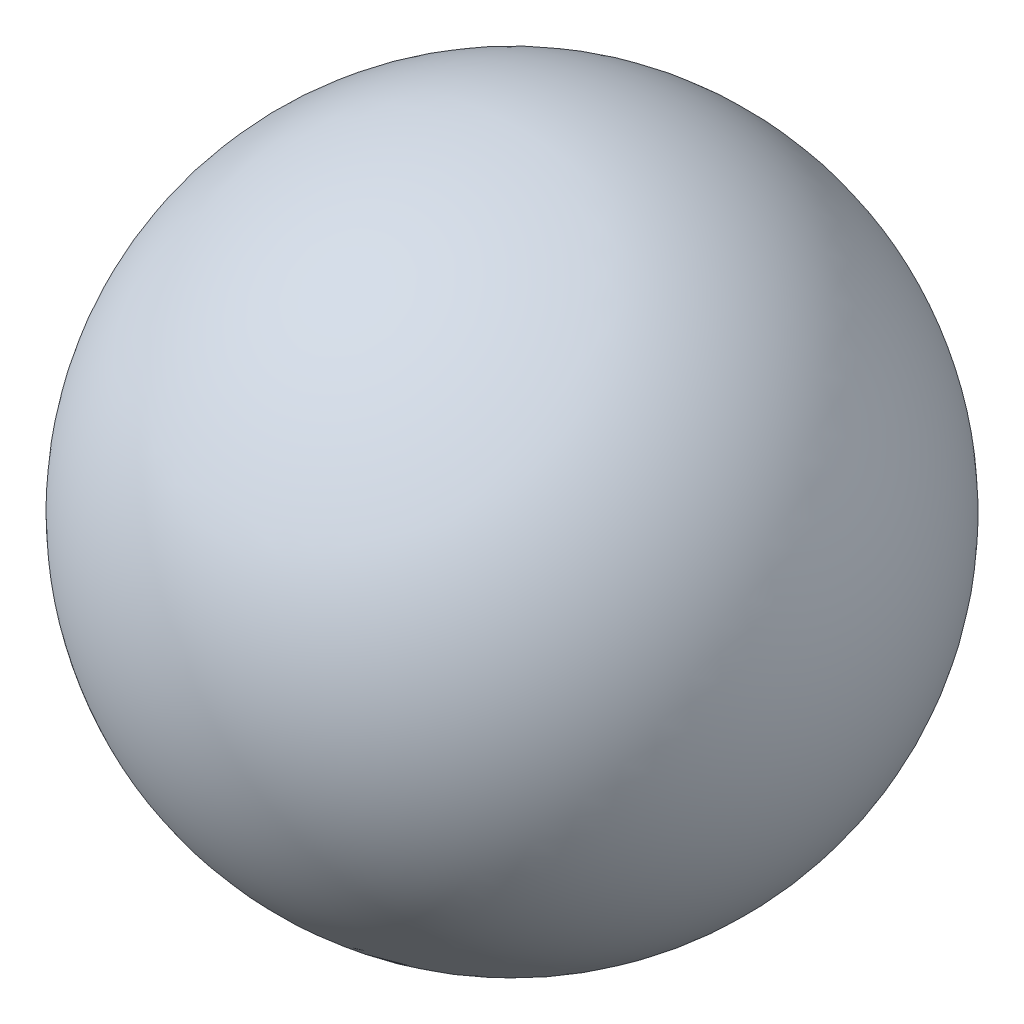
ISO-10303-21;
HEADER;
FILE_DESCRIPTION(('STEP AP214'),'2;1');
FILE_NAME('part.step','',(''),(''),'','','');
FILE_SCHEMA(('AUTOMOTIVE_DESIGN { 1 0 10303 214 1 1 1 1 }'));
ENDSEC;
DATA;
#1=APPLICATION_CONTEXT('core data for automotive mechanical design processes');
#2=APPLICATION_PROTOCOL_DEFINITION('international standard','automotive_design',2000,#1);
#3=PRODUCT_CONTEXT('',#1,'mechanical');
#4=PRODUCT('Part','Part','',(#3));
#5=PRODUCT_RELATED_PRODUCT_CATEGORY('part','',(#4));
#6=PRODUCT_DEFINITION_FORMATION('','',#4);
#7=PRODUCT_DEFINITION_CONTEXT('part definition',#1,'design');
#8=PRODUCT_DEFINITION('design','',#6,#7);
#9=PRODUCT_DEFINITION_SHAPE('','',#8);
#10=(LENGTH_UNIT() NAMED_UNIT(*) SI_UNIT(.MILLI.,.METRE.));
#11=(NAMED_UNIT(*) PLANE_ANGLE_UNIT() SI_UNIT($,.RADIAN.));
#12=(NAMED_UNIT(*) SI_UNIT($,.STERADIAN.) SOLID_ANGLE_UNIT());
#13=UNCERTAINTY_MEASURE_WITH_UNIT(LENGTH_MEASURE(1.E-05),#10,'distance_accuracy_value','');
#14=(GEOMETRIC_REPRESENTATION_CONTEXT(3) GLOBAL_UNCERTAINTY_ASSIGNED_CONTEXT((#13)) GLOBAL_UNIT_ASSIGNED_CONTEXT((#10,
#11,#12)) REPRESENTATION_CONTEXT('',''));
#15=CARTESIAN_POINT('',(0.,0.,0.));
#16=DIRECTION('',(0.,0.,1.));
#17=DIRECTION('',(1.,0.,0.));
#18=AXIS2_PLACEMENT_3D('',#15,#16,#17);
#19=CARTESIAN_POINT('',(64.16,8.84745707434975,68.816590966987));
#20=DIRECTION('',(0.,0.127516208211662,0.991836486848176));
#21=DIRECTION('',(0.173648177666934,-0.976768261968468,0.125578950481563));
#22=AXIS2_PLACEMENT_3D('',#19,#20,#21);
#23=SPHERICAL_SURFACE('',#22,7.15);
#24=CARTESIAN_POINT('',(64.16,9.75919796306313,75.9082218479514));
#25=VERTEX_POINT('',#24);
#26=VERTEX_LOOP('',#25);
#27=FACE_BOUND('',#26,.T.);
#28=CARTESIAN_POINT('',(64.16,7.93571618563638,61.7249600860226));
#29=VERTEX_POINT('',#28);
#30=VERTEX_LOOP('',#29);
#31=FACE_BOUND('',#30,.T.);
#32=ADVANCED_FACE('F15',(#27,#31),#23,.T.);
#33=CLOSED_SHELL('',(#32));
#34=MANIFOLD_SOLID_BREP('B1',#33);
#35=ADVANCED_BREP_SHAPE_REPRESENTATION('',(#18,#34),#14);
#36=SHAPE_DEFINITION_REPRESENTATION(#9,#35);
ENDSEC;
END-ISO-10303-21;
